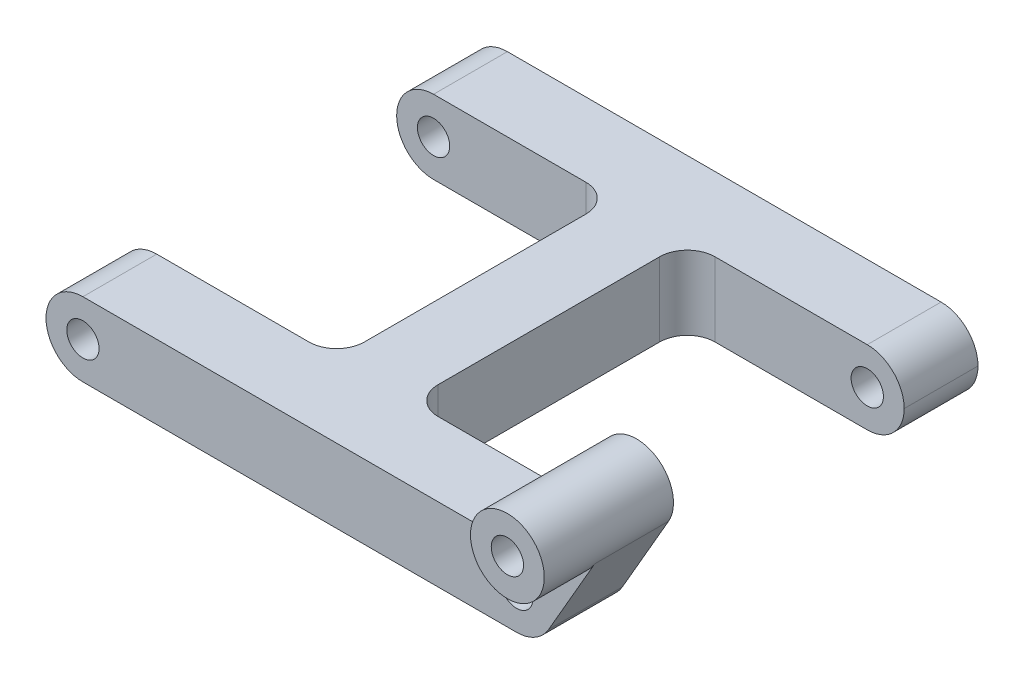
ISO-10303-21;
HEADER;
FILE_DESCRIPTION(('STEP AP214'),'2;1');
FILE_NAME('part.step','',(''),(''),'','','');
FILE_SCHEMA(('AUTOMOTIVE_DESIGN { 1 0 10303 214 1 1 1 1 }'));
ENDSEC;
DATA;
#1=APPLICATION_CONTEXT('core data for automotive mechanical design processes');
#2=APPLICATION_PROTOCOL_DEFINITION('international standard','automotive_design',2000,#1);
#3=PRODUCT_CONTEXT('',#1,'mechanical');
#4=PRODUCT('Part','Part','',(#3));
#5=PRODUCT_RELATED_PRODUCT_CATEGORY('part','',(#4));
#6=PRODUCT_DEFINITION_FORMATION('','',#4);
#7=PRODUCT_DEFINITION_CONTEXT('part definition',#1,'design');
#8=PRODUCT_DEFINITION('design','',#6,#7);
#9=PRODUCT_DEFINITION_SHAPE('','',#8);
#10=(LENGTH_UNIT() NAMED_UNIT(*) SI_UNIT(.MILLI.,.METRE.));
#11=(NAMED_UNIT(*) PLANE_ANGLE_UNIT() SI_UNIT($,.RADIAN.));
#12=(NAMED_UNIT(*) SI_UNIT($,.STERADIAN.) SOLID_ANGLE_UNIT());
#13=UNCERTAINTY_MEASURE_WITH_UNIT(LENGTH_MEASURE(1.E-05),#10,'distance_accuracy_value','');
#14=(GEOMETRIC_REPRESENTATION_CONTEXT(3) GLOBAL_UNCERTAINTY_ASSIGNED_CONTEXT((#13)) GLOBAL_UNIT_ASSIGNED_CONTEXT((#10,
#11,#12)) REPRESENTATION_CONTEXT('',''));
#15=CARTESIAN_POINT('',(0.,0.,0.));
#16=DIRECTION('',(0.,0.,1.));
#17=DIRECTION('',(1.,0.,0.));
#18=AXIS2_PLACEMENT_3D('',#15,#16,#17);
#19=CARTESIAN_POINT('',(-23.5,1.3965925355343E-13,-23.));
#20=DIRECTION('',(0.,0.,1.));
#21=DIRECTION('',(1.,0.,0.));
#22=AXIS2_PLACEMENT_3D('',#19,#20,#21);
#23=CYLINDRICAL_SURFACE('',#22,1.74999999999996);
#24=CARTESIAN_POINT('',(-23.5,1.3965925355343E-13,-15.));
#25=DIRECTION('',(0.,0.,-1.));
#26=DIRECTION('',(-1.,0.,0.));
#27=AXIS2_PLACEMENT_3D('',#24,#25,#26);
#28=CIRCLE('',#27,1.74999999999996);
#29=CARTESIAN_POINT('',(-25.25,1.3965925355343E-13,-15.));
#30=VERTEX_POINT('',#29);
#31=EDGE_CURVE('E228',#30,#30,#28,.T.);
#32=ORIENTED_EDGE('',*,*,#31,.F.);
#33=EDGE_LOOP('',(#32));
#34=FACE_BOUND('',#33,.T.);
#35=CARTESIAN_POINT('',(-23.5,1.3965925355343E-13,-19.8));
#36=DIRECTION('',(0.,0.,-1.));
#37=DIRECTION('',(-1.,0.,0.));
#38=AXIS2_PLACEMENT_3D('',#35,#36,#37);
#39=CIRCLE('',#38,1.74999999999996);
#40=CARTESIAN_POINT('',(-25.25,1.3965925355343E-13,-19.8));
#41=VERTEX_POINT('',#40);
#42=EDGE_CURVE('E40',#41,#41,#39,.F.);
#43=ORIENTED_EDGE('',*,*,#42,.F.);
#44=EDGE_LOOP('',(#43));
#45=FACE_BOUND('',#44,.T.);
#46=ADVANCED_FACE('F36',(#34,#45),#23,.F.);
#47=CARTESIAN_POINT('',(0.,4.,0.));
#48=DIRECTION('',(0.,1.,0.));
#49=DIRECTION('',(0.,0.,1.));
#50=AXIS2_PLACEMENT_3D('',#47,#48,#49);
#51=PLANE('',#50);
#52=DIRECTION('',(1.,0.,0.));
#53=VECTOR('',#52,1.);
#54=CARTESIAN_POINT('',(27.5,4.,23.));
#55=LINE('',#54,#53);
#56=CARTESIAN_POINT('',(-23.5,4.,23.));
#57=VERTEX_POINT('',#56);
#58=CARTESIAN_POINT('',(21.1905989232415,4.,23.));
#59=VERTEX_POINT('',#58);
#60=EDGE_CURVE('E247',#57,#59,#55,.T.);
#61=ORIENTED_EDGE('',*,*,#60,.T.);
#62=DIRECTION('',(0.,0.,-1.));
#63=VECTOR('',#62,1.);
#64=CARTESIAN_POINT('',(21.1905989232415,4.,0.));
#65=LINE('',#64,#63);
#66=CARTESIAN_POINT('',(21.1905989232415,4.,15.));
#67=VERTEX_POINT('',#66);
#68=EDGE_CURVE('E45',#59,#67,#65,.T.);
#69=ORIENTED_EDGE('',*,*,#68,.T.);
#70=DIRECTION('',(-1.,0.,0.));
#71=VECTOR('',#70,1.);
#72=CARTESIAN_POINT('',(27.5,4.,15.));
#73=LINE('',#72,#71);
#74=CARTESIAN_POINT('',(7.00000000000001,4.,15.));
#75=VERTEX_POINT('',#74);
#76=EDGE_CURVE('E250',#67,#75,#73,.T.);
#77=ORIENTED_EDGE('',*,*,#76,.T.);
#78=CARTESIAN_POINT('',(7.,4.,12.));
#79=DIRECTION('',(0.,1.,0.));
#80=DIRECTION('',(0.,0.,1.));
#81=AXIS2_PLACEMENT_3D('',#78,#79,#80);
#82=CIRCLE('',#81,3.);
#83=CARTESIAN_POINT('',(4.,4.,12.));
#84=VERTEX_POINT('',#83);
#85=EDGE_CURVE('E363',#75,#84,#82,.F.);
#86=ORIENTED_EDGE('',*,*,#85,.T.);
#87=DIRECTION('',(0.,0.,-1.));
#88=VECTOR('',#87,1.);
#89=CARTESIAN_POINT('',(4.,4.,15.));
#90=LINE('',#89,#88);
#91=CARTESIAN_POINT('',(4.,4.,-12.));
#92=VERTEX_POINT('',#91);
#93=EDGE_CURVE('E252',#84,#92,#90,.T.);
#94=ORIENTED_EDGE('',*,*,#93,.T.);
#95=CARTESIAN_POINT('',(7.,4.,-12.));
#96=DIRECTION('',(0.,1.,0.));
#97=DIRECTION('',(0.,0.,1.));
#98=AXIS2_PLACEMENT_3D('',#95,#96,#97);
#99=CIRCLE('',#98,3.);
#100=CARTESIAN_POINT('',(7.,4.,-15.));
#101=VERTEX_POINT('',#100);
#102=EDGE_CURVE('E61',#92,#101,#99,.F.);
#103=ORIENTED_EDGE('',*,*,#102,.T.);
#104=DIRECTION('',(1.,0.,0.));
#105=VECTOR('',#104,1.);
#106=CARTESIAN_POINT('',(4.,4.,-15.));
#107=LINE('',#106,#105);
#108=CARTESIAN_POINT('',(23.5,4.,-15.));
#109=VERTEX_POINT('',#108);
#110=EDGE_CURVE('E254',#101,#109,#107,.T.);
#111=ORIENTED_EDGE('',*,*,#110,.T.);
#112=DIRECTION('',(0.,0.,-1.));
#113=VECTOR('',#112,1.);
#114=CARTESIAN_POINT('',(23.5,4.,-23.));
#115=LINE('',#114,#113);
#116=CARTESIAN_POINT('',(23.5,4.,-23.));
#117=VERTEX_POINT('',#116);
#118=EDGE_CURVE('E302',#109,#117,#115,.T.);
#119=ORIENTED_EDGE('',*,*,#118,.T.);
#120=DIRECTION('',(-1.,0.,0.));
#121=VECTOR('',#120,1.);
#122=CARTESIAN_POINT('',(27.5,4.,-23.));
#123=LINE('',#122,#121);
#124=CARTESIAN_POINT('',(-23.5,4.,-23.));
#125=VERTEX_POINT('',#124);
#126=EDGE_CURVE('E256',#117,#125,#123,.T.);
#127=ORIENTED_EDGE('',*,*,#126,.T.);
#128=DIRECTION('',(0.,0.,1.));
#129=VECTOR('',#128,1.);
#130=CARTESIAN_POINT('',(-23.5,4.,-15.));
#131=LINE('',#130,#129);
#132=CARTESIAN_POINT('',(-23.5,4.,-15.));
#133=VERTEX_POINT('',#132);
#134=EDGE_CURVE('E306',#125,#133,#131,.T.);
#135=ORIENTED_EDGE('',*,*,#134,.T.);
#136=DIRECTION('',(1.,0.,0.));
#137=VECTOR('',#136,1.);
#138=CARTESIAN_POINT('',(-4.,4.,-15.));
#139=LINE('',#138,#137);
#140=CARTESIAN_POINT('',(-7.,4.,-15.));
#141=VERTEX_POINT('',#140);
#142=EDGE_CURVE('E238',#133,#141,#139,.T.);
#143=ORIENTED_EDGE('',*,*,#142,.T.);
#144=CARTESIAN_POINT('',(-7.,4.,-12.));
#145=DIRECTION('',(0.,1.,0.));
#146=DIRECTION('',(0.,0.,1.));
#147=AXIS2_PLACEMENT_3D('',#144,#145,#146);
#148=CIRCLE('',#147,3.);
#149=CARTESIAN_POINT('',(-4.,4.,-12.));
#150=VERTEX_POINT('',#149);
#151=EDGE_CURVE('E359',#141,#150,#148,.F.);
#152=ORIENTED_EDGE('',*,*,#151,.T.);
#153=DIRECTION('',(0.,0.,1.));
#154=VECTOR('',#153,1.);
#155=CARTESIAN_POINT('',(-4.,4.,15.));
#156=LINE('',#155,#154);
#157=CARTESIAN_POINT('',(-4.,4.,12.));
#158=VERTEX_POINT('',#157);
#159=EDGE_CURVE('E241',#150,#158,#156,.T.);
#160=ORIENTED_EDGE('',*,*,#159,.T.);
#161=CARTESIAN_POINT('',(-7.,4.,12.));
#162=DIRECTION('',(0.,1.,0.));
#163=DIRECTION('',(0.,0.,1.));
#164=AXIS2_PLACEMENT_3D('',#161,#162,#163);
#165=CIRCLE('',#164,3.);
#166=CARTESIAN_POINT('',(-7.,4.,15.));
#167=VERTEX_POINT('',#166);
#168=EDGE_CURVE('E355',#158,#167,#165,.F.);
#169=ORIENTED_EDGE('',*,*,#168,.T.);
#170=DIRECTION('',(-1.,0.,0.));
#171=VECTOR('',#170,1.);
#172=CARTESIAN_POINT('',(-27.5,4.,15.));
#173=LINE('',#172,#171);
#174=CARTESIAN_POINT('',(-23.5,4.,15.));
#175=VERTEX_POINT('',#174);
#176=EDGE_CURVE('E245',#167,#175,#173,.T.);
#177=ORIENTED_EDGE('',*,*,#176,.T.);
#178=DIRECTION('',(0.,0.,1.));
#179=VECTOR('',#178,1.);
#180=CARTESIAN_POINT('',(-23.5,4.,23.));
#181=LINE('',#180,#179);
#182=EDGE_CURVE('E304',#175,#57,#181,.T.);
#183=ORIENTED_EDGE('',*,*,#182,.T.);
#184=EDGE_LOOP('',(#61,#69,#77,#86,#94,#103,#111,#119,#127,#135,#143,#152,#160,#169,#177,#183));
#185=FACE_BOUND('',#184,.T.);
#186=ADVANCED_FACE('F369',(#185),#51,.T.);
#187=CARTESIAN_POINT('',(23.5,0.,23.));
#188=DIRECTION('',(0.,0.,-1.));
#189=DIRECTION('',(-1.,0.,0.));
#190=AXIS2_PLACEMENT_3D('',#187,#188,#189);
#191=CYLINDRICAL_SURFACE('',#190,4.);
#192=CARTESIAN_POINT('',(23.5,0.,15.));
#193=DIRECTION('',(0.,0.,1.));
#194=DIRECTION('',(1.,0.,0.));
#195=AXIS2_PLACEMENT_3D('',#192,#193,#194);
#196=CIRCLE('',#195,4.);
#197=CARTESIAN_POINT('',(26.9641016151378,-2.,15.));
#198=VERTEX_POINT('',#197);
#199=CARTESIAN_POINT('',(23.5,-4.,15.));
#200=VERTEX_POINT('',#199);
#201=EDGE_CURVE('E323',#198,#200,#196,.F.);
#202=ORIENTED_EDGE('',*,*,#201,.F.);
#203=DIRECTION('',(0.,0.,-1.));
#204=VECTOR('',#203,1.);
#205=CARTESIAN_POINT('',(26.9641016151378,-2.,23.));
#206=LINE('',#205,#204);
#207=CARTESIAN_POINT('',(26.9641016151378,-2.,23.));
#208=VERTEX_POINT('',#207);
#209=EDGE_CURVE('E208',#208,#198,#206,.T.);
#210=ORIENTED_EDGE('',*,*,#209,.F.);
#211=CARTESIAN_POINT('',(23.5,0.,23.));
#212=DIRECTION('',(0.,0.,-1.));
#213=DIRECTION('',(-1.,0.,0.));
#214=AXIS2_PLACEMENT_3D('',#211,#212,#213);
#215=CIRCLE('',#214,4.);
#216=CARTESIAN_POINT('',(23.5,-4.,23.));
#217=VERTEX_POINT('',#216);
#218=EDGE_CURVE('E202',#217,#208,#215,.F.);
#219=ORIENTED_EDGE('',*,*,#218,.F.);
#220=DIRECTION('',(0.,0.,-1.));
#221=VECTOR('',#220,1.);
#222=CARTESIAN_POINT('',(23.5,-4.,0.));
#223=LINE('',#222,#221);
#224=EDGE_CURVE('E282',#200,#217,#223,.F.);
#225=ORIENTED_EDGE('',*,*,#224,.F.);
#226=EDGE_LOOP('',(#202,#210,#219,#225));
#227=FACE_BOUND('',#226,.T.);
#228=ADVANCED_FACE('F478',(#227),#191,.T.);
#229=CARTESIAN_POINT('',(-4.,4.,-15.));
#230=DIRECTION('',(0.,0.,-1.));
#231=DIRECTION('',(-1.,0.,0.));
#232=AXIS2_PLACEMENT_3D('',#229,#230,#231);
#233=PLANE('',#232);
#234=ORIENTED_EDGE('',*,*,#31,.T.);
#235=EDGE_LOOP('',(#234));
#236=FACE_BOUND('',#235,.T.);
#237=DIRECTION('',(1.,0.,0.));
#238=VECTOR('',#237,1.);
#239=CARTESIAN_POINT('',(-4.,-4.,-15.));
#240=LINE('',#239,#238);
#241=CARTESIAN_POINT('',(-23.5,-4.,-15.));
#242=VERTEX_POINT('',#241);
#243=CARTESIAN_POINT('',(-7.,-4.,-15.));
#244=VERTEX_POINT('',#243);
#245=EDGE_CURVE('E237',#242,#244,#240,.T.);
#246=ORIENTED_EDGE('',*,*,#245,.T.);
#247=DIRECTION('',(0.,-1.,0.));
#248=VECTOR('',#247,1.);
#249=CARTESIAN_POINT('',(-7.,4.,-15.));
#250=LINE('',#249,#248);
#251=EDGE_CURVE('E340',#244,#141,#250,.F.);
#252=ORIENTED_EDGE('',*,*,#251,.T.);
#253=ORIENTED_EDGE('',*,*,#142,.F.);
#254=CARTESIAN_POINT('',(-23.5,0.,-15.));
#255=DIRECTION('',(0.,0.,-1.));
#256=DIRECTION('',(-1.,0.,0.));
#257=AXIS2_PLACEMENT_3D('',#254,#255,#256);
#258=CIRCLE('',#257,4.);
#259=CARTESIAN_POINT('',(-27.5,0.,-15.));
#260=VERTEX_POINT('',#259);
#261=EDGE_CURVE('E259',#133,#260,#258,.F.);
#262=ORIENTED_EDGE('',*,*,#261,.T.);
#263=CARTESIAN_POINT('',(-23.5,0.,-15.));
#264=DIRECTION('',(0.,0.,-1.));
#265=DIRECTION('',(-1.,0.,0.));
#266=AXIS2_PLACEMENT_3D('',#263,#264,#265);
#267=CIRCLE('',#266,4.);
#268=EDGE_CURVE('E280',#260,#242,#267,.F.);
#269=ORIENTED_EDGE('',*,*,#268,.T.);
#270=EDGE_LOOP('',(#246,#252,#253,#262,#269));
#271=FACE_BOUND('',#270,.T.);
#272=ADVANCED_FACE('F421',(#236,#271),#233,.F.);
#273=CARTESIAN_POINT('',(-4.,4.,15.));
#274=DIRECTION('',(1.,0.,0.));
#275=DIRECTION('',(0.,0.,-1.));
#276=AXIS2_PLACEMENT_3D('',#273,#274,#275);
#277=PLANE('',#276);
#278=DIRECTION('',(0.,0.,1.));
#279=VECTOR('',#278,1.);
#280=CARTESIAN_POINT('',(-4.,-4.,15.));
#281=LINE('',#280,#279);
#282=CARTESIAN_POINT('',(-4.,-4.,-12.));
#283=VERTEX_POINT('',#282);
#284=CARTESIAN_POINT('',(-4.,-4.,12.));
#285=VERTEX_POINT('',#284);
#286=EDGE_CURVE('E262',#283,#285,#281,.T.);
#287=ORIENTED_EDGE('',*,*,#286,.T.);
#288=DIRECTION('',(0.,-1.,0.));
#289=VECTOR('',#288,1.);
#290=CARTESIAN_POINT('',(-4.,4.,12.));
#291=LINE('',#290,#289);
#292=EDGE_CURVE('E338',#285,#158,#291,.F.);
#293=ORIENTED_EDGE('',*,*,#292,.T.);
#294=ORIENTED_EDGE('',*,*,#159,.F.);
#295=DIRECTION('',(0.,-1.,0.));
#296=VECTOR('',#295,1.);
#297=CARTESIAN_POINT('',(-4.,-4.,-12.));
#298=LINE('',#297,#296);
#299=EDGE_CURVE('E335',#150,#283,#298,.T.);
#300=ORIENTED_EDGE('',*,*,#299,.T.);
#301=EDGE_LOOP('',(#287,#293,#294,#300));
#302=FACE_BOUND('',#301,.T.);
#303=ADVANCED_FACE('F431',(#302),#277,.F.);
#304=CARTESIAN_POINT('',(-27.5,4.,15.));
#305=DIRECTION('',(0.,0.,1.));
#306=DIRECTION('',(1.,0.,0.));
#307=AXIS2_PLACEMENT_3D('',#304,#305,#306);
#308=PLANE('',#307);
#309=CARTESIAN_POINT('',(-23.5,1.3965925355343E-13,15.));
#310=DIRECTION('',(0.,0.,1.));
#311=DIRECTION('',(1.,0.,0.));
#312=AXIS2_PLACEMENT_3D('',#309,#310,#311);
#313=CIRCLE('',#312,1.74999999999996);
#314=CARTESIAN_POINT('',(-21.75,1.3965925355343E-13,15.));
#315=VERTEX_POINT('',#314);
#316=EDGE_CURVE('E218',#315,#315,#313,.T.);
#317=ORIENTED_EDGE('',*,*,#316,.T.);
#318=EDGE_LOOP('',(#317));
#319=FACE_BOUND('',#318,.T.);
#320=ORIENTED_EDGE('',*,*,#176,.F.);
#321=DIRECTION('',(0.,-1.,0.));
#322=VECTOR('',#321,1.);
#323=CARTESIAN_POINT('',(-7.,-4.,15.));
#324=LINE('',#323,#322);
#325=CARTESIAN_POINT('',(-7.,-4.,15.));
#326=VERTEX_POINT('',#325);
#327=EDGE_CURVE('E325',#167,#326,#324,.T.);
#328=ORIENTED_EDGE('',*,*,#327,.T.);
#329=DIRECTION('',(-1.,0.,0.));
#330=VECTOR('',#329,1.);
#331=CARTESIAN_POINT('',(-27.5,-4.,15.));
#332=LINE('',#331,#330);
#333=CARTESIAN_POINT('',(-23.5,-4.,15.));
#334=VERTEX_POINT('',#333);
#335=EDGE_CURVE('E265',#326,#334,#332,.T.);
#336=ORIENTED_EDGE('',*,*,#335,.T.);
#337=CARTESIAN_POINT('',(-23.5,0.,15.));
#338=DIRECTION('',(0.,0.,1.));
#339=DIRECTION('',(1.,0.,0.));
#340=AXIS2_PLACEMENT_3D('',#337,#338,#339);
#341=CIRCLE('',#340,4.);
#342=CARTESIAN_POINT('',(-27.5,0.,15.));
#343=VERTEX_POINT('',#342);
#344=EDGE_CURVE('E316',#334,#343,#341,.F.);
#345=ORIENTED_EDGE('',*,*,#344,.T.);
#346=CARTESIAN_POINT('',(-23.5,0.,15.));
#347=DIRECTION('',(0.,0.,1.));
#348=DIRECTION('',(1.,0.,0.));
#349=AXIS2_PLACEMENT_3D('',#346,#347,#348);
#350=CIRCLE('',#349,4.);
#351=EDGE_CURVE('E313',#343,#175,#350,.F.);
#352=ORIENTED_EDGE('',*,*,#351,.T.);
#353=EDGE_LOOP('',(#320,#328,#336,#345,#352));
#354=FACE_BOUND('',#353,.T.);
#355=ADVANCED_FACE('F440',(#319,#354),#308,.F.);
#356=CARTESIAN_POINT('',(27.5,4.,23.));
#357=DIRECTION('',(0.,0.,-1.));
#358=DIRECTION('',(-1.,0.,0.));
#359=AXIS2_PLACEMENT_3D('',#356,#357,#358);
#360=PLANE('',#359);
#361=DIRECTION('',(0.499999999999999,0.866025403784439,0.));
#362=VECTOR('',#361,1.);
#363=CARTESIAN_POINT('',(29.6961524227066,2.73205080756888,23.));
#364=LINE('',#363,#362);
#365=CARTESIAN_POINT('',(31.9641016151377,6.6602540378444,23.));
#366=VERTEX_POINT('',#365);
#367=EDGE_CURVE('E53',#208,#366,#364,.T.);
#368=ORIENTED_EDGE('',*,*,#367,.T.);
#369=CARTESIAN_POINT('',(28.5,8.6602540378444,23.));
#370=DIRECTION('',(0.,0.,-1.));
#371=DIRECTION('',(-1.,0.,0.));
#372=AXIS2_PLACEMENT_3D('',#369,#370,#371);
#373=CIRCLE('',#372,4.);
#374=CARTESIAN_POINT('',(25.0358983848622,10.6602540378444,23.));
#375=VERTEX_POINT('',#374);
#376=EDGE_CURVE('E11',#366,#375,#373,.T.);
#377=ORIENTED_EDGE('',*,*,#376,.T.);
#378=DIRECTION('',(-0.499999999999996,-0.866025403784441,0.));
#379=VECTOR('',#378,1.);
#380=CARTESIAN_POINT('',(22.7679491924311,6.73205080756886,23.));
#381=LINE('',#380,#379);
#382=EDGE_CURVE('E203',#375,#59,#381,.T.);
#383=ORIENTED_EDGE('',*,*,#382,.T.);
#384=ORIENTED_EDGE('',*,*,#60,.F.);
#385=CARTESIAN_POINT('',(-23.5,0.,23.));
#386=DIRECTION('',(0.,0.,-1.));
#387=DIRECTION('',(-1.,0.,0.));
#388=AXIS2_PLACEMENT_3D('',#385,#386,#387);
#389=CIRCLE('',#388,4.);
#390=CARTESIAN_POINT('',(-27.5,0.,23.));
#391=VERTEX_POINT('',#390);
#392=EDGE_CURVE('E309',#57,#391,#389,.F.);
#393=ORIENTED_EDGE('',*,*,#392,.T.);
#394=CARTESIAN_POINT('',(-23.5,0.,23.));
#395=DIRECTION('',(0.,0.,-1.));
#396=DIRECTION('',(-1.,0.,0.));
#397=AXIS2_PLACEMENT_3D('',#394,#395,#396);
#398=CIRCLE('',#397,4.);
#399=CARTESIAN_POINT('',(-23.5,-4.,23.));
#400=VERTEX_POINT('',#399);
#401=EDGE_CURVE('E311',#391,#400,#398,.F.);
#402=ORIENTED_EDGE('',*,*,#401,.T.);
#403=DIRECTION('',(1.,0.,0.));
#404=VECTOR('',#403,1.);
#405=CARTESIAN_POINT('',(27.5,-4.,23.));
#406=LINE('',#405,#404);
#407=EDGE_CURVE('E267',#400,#217,#406,.T.);
#408=ORIENTED_EDGE('',*,*,#407,.T.);
#409=ORIENTED_EDGE('',*,*,#218,.T.);
#410=EDGE_LOOP('',(#368,#377,#383,#384,#393,#402,#408,#409));
#411=FACE_BOUND('',#410,.T.);
#412=CARTESIAN_POINT('',(23.5,0.,23.));
#413=DIRECTION('',(0.,0.,1.));
#414=DIRECTION('',(1.,0.,0.));
#415=AXIS2_PLACEMENT_3D('',#412,#413,#414);
#416=CIRCLE('',#415,1.75);
#417=CARTESIAN_POINT('',(25.25,0.,23.));
#418=VERTEX_POINT('',#417);
#419=EDGE_CURVE('E219',#418,#418,#416,.T.);
#420=ORIENTED_EDGE('',*,*,#419,.F.);
#421=EDGE_LOOP('',(#420));
#422=FACE_BOUND('',#421,.T.);
#423=CARTESIAN_POINT('',(-23.5,1.3965925355343E-13,23.));
#424=DIRECTION('',(0.,0.,1.));
#425=DIRECTION('',(1.,0.,0.));
#426=AXIS2_PLACEMENT_3D('',#423,#424,#425);
#427=CIRCLE('',#426,1.74999999999996);
#428=CARTESIAN_POINT('',(-21.75,1.3965925355343E-13,23.));
#429=VERTEX_POINT('',#428);
#430=EDGE_CURVE('E222',#429,#429,#427,.T.);
#431=ORIENTED_EDGE('',*,*,#430,.F.);
#432=EDGE_LOOP('',(#431));
#433=FACE_BOUND('',#432,.T.);
#434=ADVANCED_FACE('F199',(#411,#422,#433),#360,.F.);
#435=CARTESIAN_POINT('',(27.5,4.,15.));
#436=DIRECTION('',(0.,0.,1.));
#437=DIRECTION('',(1.,0.,0.));
#438=AXIS2_PLACEMENT_3D('',#435,#436,#437);
#439=PLANE('',#438);
#440=ORIENTED_EDGE('',*,*,#201,.T.);
#441=DIRECTION('',(-1.,0.,0.));
#442=VECTOR('',#441,1.);
#443=CARTESIAN_POINT('',(27.5,-4.,15.));
#444=LINE('',#443,#442);
#445=CARTESIAN_POINT('',(7.00000000000001,-4.,15.));
#446=VERTEX_POINT('',#445);
#447=EDGE_CURVE('E269',#200,#446,#444,.T.);
#448=ORIENTED_EDGE('',*,*,#447,.T.);
#449=DIRECTION('',(0.,-1.,0.));
#450=VECTOR('',#449,1.);
#451=CARTESIAN_POINT('',(7.,4.,15.));
#452=LINE('',#451,#450);
#453=EDGE_CURVE('E347',#446,#75,#452,.F.);
#454=ORIENTED_EDGE('',*,*,#453,.T.);
#455=ORIENTED_EDGE('',*,*,#76,.F.);
#456=DIRECTION('',(-0.499999999999996,-0.866025403784441,0.));
#457=VECTOR('',#456,1.);
#458=CARTESIAN_POINT('',(22.7679491924311,6.73205080756886,15.));
#459=LINE('',#458,#457);
#460=CARTESIAN_POINT('',(25.0358983848622,10.6602540378444,15.));
#461=VERTEX_POINT('',#460);
#462=EDGE_CURVE('E204',#461,#67,#459,.T.);
#463=ORIENTED_EDGE('',*,*,#462,.F.);
#464=CARTESIAN_POINT('',(28.5,8.6602540378444,15.));
#465=DIRECTION('',(0.,0.,1.));
#466=DIRECTION('',(1.,0.,0.));
#467=AXIS2_PLACEMENT_3D('',#464,#465,#466);
#468=CIRCLE('',#467,4.00000000000001);
#469=CARTESIAN_POINT('',(31.9641016151378,6.66025403784441,15.));
#470=VERTEX_POINT('',#469);
#471=EDGE_CURVE('E457',#470,#461,#468,.T.);
#472=ORIENTED_EDGE('',*,*,#471,.F.);
#473=DIRECTION('',(0.499999999999999,0.866025403784439,0.));
#474=VECTOR('',#473,1.);
#475=CARTESIAN_POINT('',(29.6961524227066,2.73205080756888,15.));
#476=LINE('',#475,#474);
#477=EDGE_CURVE('E207',#198,#470,#476,.T.);
#478=ORIENTED_EDGE('',*,*,#477,.F.);
#479=EDGE_LOOP('',(#440,#448,#454,#455,#463,#472,#478));
#480=FACE_BOUND('',#479,.T.);
#481=CARTESIAN_POINT('',(23.5,0.,15.));
#482=DIRECTION('',(0.,0.,1.));
#483=DIRECTION('',(1.,0.,0.));
#484=AXIS2_PLACEMENT_3D('',#481,#482,#483);
#485=CIRCLE('',#484,1.75);
#486=CARTESIAN_POINT('',(25.25,0.,15.));
#487=VERTEX_POINT('',#486);
#488=EDGE_CURVE('E234',#487,#487,#485,.T.);
#489=ORIENTED_EDGE('',*,*,#488,.T.);
#490=EDGE_LOOP('',(#489));
#491=FACE_BOUND('',#490,.T.);
#492=CARTESIAN_POINT('',(28.5,8.6602540378444,15.));
#493=DIRECTION('',(0.,0.,1.));
#494=DIRECTION('',(1.,0.,0.));
#495=AXIS2_PLACEMENT_3D('',#492,#493,#494);
#496=CIRCLE('',#495,1.75);
#497=CARTESIAN_POINT('',(30.25,8.6602540378444,15.));
#498=VERTEX_POINT('',#497);
#499=EDGE_CURVE('E458',#498,#498,#496,.T.);
#500=ORIENTED_EDGE('',*,*,#499,.T.);
#501=EDGE_LOOP('',(#500));
#502=FACE_BOUND('',#501,.T.);
#503=ADVANCED_FACE('F374',(#480,#491,#502),#439,.F.);
#504=CARTESIAN_POINT('',(4.,4.,15.));
#505=DIRECTION('',(-1.,0.,0.));
#506=DIRECTION('',(0.,0.,1.));
#507=AXIS2_PLACEMENT_3D('',#504,#505,#506);
#508=PLANE('',#507);
#509=ORIENTED_EDGE('',*,*,#93,.F.);
#510=DIRECTION('',(0.,-1.,0.));
#511=VECTOR('',#510,1.);
#512=CARTESIAN_POINT('',(4.,-4.,12.));
#513=LINE('',#512,#511);
#514=CARTESIAN_POINT('',(4.,-4.,12.));
#515=VERTEX_POINT('',#514);
#516=EDGE_CURVE('E344',#84,#515,#513,.T.);
#517=ORIENTED_EDGE('',*,*,#516,.T.);
#518=DIRECTION('',(0.,0.,-1.));
#519=VECTOR('',#518,1.);
#520=CARTESIAN_POINT('',(4.,-4.,15.));
#521=LINE('',#520,#519);
#522=CARTESIAN_POINT('',(4.,-4.,-12.));
#523=VERTEX_POINT('',#522);
#524=EDGE_CURVE('E272',#515,#523,#521,.T.);
#525=ORIENTED_EDGE('',*,*,#524,.T.);
#526=DIRECTION('',(0.,-1.,0.));
#527=VECTOR('',#526,1.);
#528=CARTESIAN_POINT('',(4.,4.,-12.));
#529=LINE('',#528,#527);
#530=EDGE_CURVE('E342',#523,#92,#529,.F.);
#531=ORIENTED_EDGE('',*,*,#530,.T.);
#532=EDGE_LOOP('',(#509,#517,#525,#531));
#533=FACE_BOUND('',#532,.T.);
#534=ADVANCED_FACE('F384',(#533),#508,.F.);
#535=CARTESIAN_POINT('',(4.,4.,-15.));
#536=DIRECTION('',(0.,0.,-1.));
#537=DIRECTION('',(-1.,0.,0.));
#538=AXIS2_PLACEMENT_3D('',#535,#536,#537);
#539=PLANE('',#538);
#540=CARTESIAN_POINT('',(23.5,0.,-15.));
#541=DIRECTION('',(0.,0.,-1.));
#542=DIRECTION('',(-1.,0.,0.));
#543=AXIS2_PLACEMENT_3D('',#540,#541,#542);
#544=CIRCLE('',#543,1.75);
#545=CARTESIAN_POINT('',(21.75,0.,-15.));
#546=VERTEX_POINT('',#545);
#547=EDGE_CURVE('E231',#546,#546,#544,.T.);
#548=ORIENTED_EDGE('',*,*,#547,.T.);
#549=EDGE_LOOP('',(#548));
#550=FACE_BOUND('',#549,.T.);
#551=ORIENTED_EDGE('',*,*,#110,.F.);
#552=DIRECTION('',(0.,-1.,0.));
#553=VECTOR('',#552,1.);
#554=CARTESIAN_POINT('',(7.,-4.,-15.));
#555=LINE('',#554,#553);
#556=CARTESIAN_POINT('',(7.,-4.,-15.));
#557=VERTEX_POINT('',#556);
#558=EDGE_CURVE('E350',#101,#557,#555,.T.);
#559=ORIENTED_EDGE('',*,*,#558,.T.);
#560=DIRECTION('',(1.,0.,0.));
#561=VECTOR('',#560,1.);
#562=CARTESIAN_POINT('',(4.,-4.,-15.));
#563=LINE('',#562,#561);
#564=CARTESIAN_POINT('',(23.5,-4.,-15.));
#565=VERTEX_POINT('',#564);
#566=EDGE_CURVE('E275',#557,#565,#563,.T.);
#567=ORIENTED_EDGE('',*,*,#566,.T.);
#568=CARTESIAN_POINT('',(23.5,0.,-15.));
#569=DIRECTION('',(0.,0.,-1.));
#570=DIRECTION('',(-1.,0.,0.));
#571=AXIS2_PLACEMENT_3D('',#568,#569,#570);
#572=CIRCLE('',#571,4.);
#573=CARTESIAN_POINT('',(27.5,0.,-15.));
#574=VERTEX_POINT('',#573);
#575=EDGE_CURVE('E321',#565,#574,#572,.F.);
#576=ORIENTED_EDGE('',*,*,#575,.T.);
#577=CARTESIAN_POINT('',(23.5,0.,-15.));
#578=DIRECTION('',(0.,0.,-1.));
#579=DIRECTION('',(-1.,0.,0.));
#580=AXIS2_PLACEMENT_3D('',#577,#578,#579);
#581=CIRCLE('',#580,4.);
#582=EDGE_CURVE('E318',#574,#109,#581,.F.);
#583=ORIENTED_EDGE('',*,*,#582,.T.);
#584=EDGE_LOOP('',(#551,#559,#567,#576,#583));
#585=FACE_BOUND('',#584,.T.);
#586=ADVANCED_FACE('F391',(#550,#585),#539,.F.);
#587=CARTESIAN_POINT('',(27.5,4.,-23.));
#588=DIRECTION('',(0.,0.,1.));
#589=DIRECTION('',(1.,0.,0.));
#590=AXIS2_PLACEMENT_3D('',#587,#588,#589);
#591=PLANE('',#590);
#592=CARTESIAN_POINT('',(-23.5,1.3965925355343E-13,-23.));
#593=DIRECTION('',(0.,0.,-1.));
#594=DIRECTION('',(-1.,0.,0.));
#595=AXIS2_PLACEMENT_3D('',#592,#593,#594);
#596=CIRCLE('',#595,3.1);
#597=CARTESIAN_POINT('',(-26.6,1.3965925355343E-13,-23.));
#598=VERTEX_POINT('',#597);
#599=EDGE_CURVE('E616',#598,#598,#596,.T.);
#600=ORIENTED_EDGE('',*,*,#599,.F.);
#601=EDGE_LOOP('',(#600));
#602=FACE_BOUND('',#601,.T.);
#603=CARTESIAN_POINT('',(23.5,0.,-23.));
#604=DIRECTION('',(0.,0.,1.));
#605=DIRECTION('',(1.,0.,0.));
#606=AXIS2_PLACEMENT_3D('',#603,#604,#605);
#607=CIRCLE('',#606,1.75);
#608=CARTESIAN_POINT('',(25.25,0.,-23.));
#609=VERTEX_POINT('',#608);
#610=EDGE_CURVE('E215',#609,#609,#607,.T.);
#611=ORIENTED_EDGE('',*,*,#610,.T.);
#612=EDGE_LOOP('',(#611));
#613=FACE_BOUND('',#612,.T.);
#614=DIRECTION('',(-1.,0.,0.));
#615=VECTOR('',#614,1.);
#616=CARTESIAN_POINT('',(27.5,-4.,-23.));
#617=LINE('',#616,#615);
#618=CARTESIAN_POINT('',(23.5,-4.,-23.));
#619=VERTEX_POINT('',#618);
#620=CARTESIAN_POINT('',(-23.5,-4.,-23.));
#621=VERTEX_POINT('',#620);
#622=EDGE_CURVE('E242',#619,#621,#617,.T.);
#623=ORIENTED_EDGE('',*,*,#622,.T.);
#624=CARTESIAN_POINT('',(-23.5,0.,-23.));
#625=DIRECTION('',(0.,0.,1.));
#626=DIRECTION('',(1.,0.,0.));
#627=AXIS2_PLACEMENT_3D('',#624,#625,#626);
#628=CIRCLE('',#627,4.);
#629=CARTESIAN_POINT('',(-27.5,0.,-23.));
#630=VERTEX_POINT('',#629);
#631=EDGE_CURVE('E300',#621,#630,#628,.F.);
#632=ORIENTED_EDGE('',*,*,#631,.T.);
#633=CARTESIAN_POINT('',(-23.5,0.,-23.));
#634=DIRECTION('',(0.,0.,1.));
#635=DIRECTION('',(1.,0.,0.));
#636=AXIS2_PLACEMENT_3D('',#633,#634,#635);
#637=CIRCLE('',#636,4.);
#638=EDGE_CURVE('E298',#630,#125,#637,.F.);
#639=ORIENTED_EDGE('',*,*,#638,.T.);
#640=ORIENTED_EDGE('',*,*,#126,.F.);
#641=CARTESIAN_POINT('',(23.5,0.,-23.));
#642=DIRECTION('',(0.,0.,1.));
#643=DIRECTION('',(1.,0.,0.));
#644=AXIS2_PLACEMENT_3D('',#641,#642,#643);
#645=CIRCLE('',#644,4.);
#646=CARTESIAN_POINT('',(27.5,0.,-23.));
#647=VERTEX_POINT('',#646);
#648=EDGE_CURVE('E294',#117,#647,#645,.F.);
#649=ORIENTED_EDGE('',*,*,#648,.T.);
#650=CARTESIAN_POINT('',(23.5,0.,-23.));
#651=DIRECTION('',(0.,0.,1.));
#652=DIRECTION('',(1.,0.,0.));
#653=AXIS2_PLACEMENT_3D('',#650,#651,#652);
#654=CIRCLE('',#653,4.);
#655=EDGE_CURVE('E296',#647,#619,#654,.F.);
#656=ORIENTED_EDGE('',*,*,#655,.T.);
#657=EDGE_LOOP('',(#623,#632,#639,#640,#649,#656));
#658=FACE_BOUND('',#657,.T.);
#659=ADVANCED_FACE('F410',(#602,#613,#658),#591,.F.);
#660=CARTESIAN_POINT('',(0.,-4.,0.));
#661=DIRECTION('',(0.,1.,0.));
#662=DIRECTION('',(0.,0.,1.));
#663=AXIS2_PLACEMENT_3D('',#660,#661,#662);
#664=PLANE('',#663);
#665=ORIENTED_EDGE('',*,*,#245,.F.);
#666=DIRECTION('',(0.,0.,1.));
#667=VECTOR('',#666,1.);
#668=CARTESIAN_POINT('',(-23.5,-4.,0.));
#669=LINE('',#668,#667);
#670=EDGE_CURVE('E291',#242,#621,#669,.F.);
#671=ORIENTED_EDGE('',*,*,#670,.T.);
#672=ORIENTED_EDGE('',*,*,#622,.F.);
#673=DIRECTION('',(0.,0.,-1.));
#674=VECTOR('',#673,1.);
#675=CARTESIAN_POINT('',(23.5,-4.,0.));
#676=LINE('',#675,#674);
#677=EDGE_CURVE('E285',#619,#565,#676,.F.);
#678=ORIENTED_EDGE('',*,*,#677,.T.);
#679=ORIENTED_EDGE('',*,*,#566,.F.);
#680=CARTESIAN_POINT('',(7.,-4.,-12.));
#681=DIRECTION('',(0.,1.,0.));
#682=DIRECTION('',(0.,0.,1.));
#683=AXIS2_PLACEMENT_3D('',#680,#681,#682);
#684=CIRCLE('',#683,3.);
#685=EDGE_CURVE('E365',#557,#523,#684,.T.);
#686=ORIENTED_EDGE('',*,*,#685,.T.);
#687=ORIENTED_EDGE('',*,*,#524,.F.);
#688=CARTESIAN_POINT('',(7.,-4.,12.));
#689=DIRECTION('',(0.,1.,0.));
#690=DIRECTION('',(0.,0.,1.));
#691=AXIS2_PLACEMENT_3D('',#688,#689,#690);
#692=CIRCLE('',#691,3.);
#693=EDGE_CURVE('E361',#515,#446,#692,.T.);
#694=ORIENTED_EDGE('',*,*,#693,.T.);
#695=ORIENTED_EDGE('',*,*,#447,.F.);
#696=ORIENTED_EDGE('',*,*,#224,.T.);
#697=ORIENTED_EDGE('',*,*,#407,.F.);
#698=DIRECTION('',(0.,0.,1.));
#699=VECTOR('',#698,1.);
#700=CARTESIAN_POINT('',(-23.5,-4.,0.));
#701=LINE('',#700,#699);
#702=EDGE_CURVE('E288',#400,#334,#701,.F.);
#703=ORIENTED_EDGE('',*,*,#702,.T.);
#704=ORIENTED_EDGE('',*,*,#335,.F.);
#705=CARTESIAN_POINT('',(-7.,-4.,12.));
#706=DIRECTION('',(0.,1.,0.));
#707=DIRECTION('',(0.,0.,1.));
#708=AXIS2_PLACEMENT_3D('',#705,#706,#707);
#709=CIRCLE('',#708,3.);
#710=EDGE_CURVE('E353',#326,#285,#709,.T.);
#711=ORIENTED_EDGE('',*,*,#710,.T.);
#712=ORIENTED_EDGE('',*,*,#286,.F.);
#713=CARTESIAN_POINT('',(-7.,-4.,-12.));
#714=DIRECTION('',(0.,1.,0.));
#715=DIRECTION('',(0.,0.,1.));
#716=AXIS2_PLACEMENT_3D('',#713,#714,#715);
#717=CIRCLE('',#716,3.);
#718=EDGE_CURVE('E357',#283,#244,#717,.T.);
#719=ORIENTED_EDGE('',*,*,#718,.T.);
#720=EDGE_LOOP('',(#665,#671,#672,#678,#679,#686,#687,#694,#695,#696,#697,#703,#704,#711,#712,#719));
#721=FACE_BOUND('',#720,.T.);
#722=ADVANCED_FACE('F395',(#721),#664,.F.);
#723=CARTESIAN_POINT('',(23.5,0.,-23.));
#724=DIRECTION('',(0.,0.,1.));
#725=DIRECTION('',(1.,0.,0.));
#726=AXIS2_PLACEMENT_3D('',#723,#724,#725);
#727=CYLINDRICAL_SURFACE('',#726,1.75);
#728=ORIENTED_EDGE('',*,*,#610,.F.);
#729=EDGE_LOOP('',(#728));
#730=FACE_BOUND('',#729,.T.);
#731=ORIENTED_EDGE('',*,*,#547,.F.);
#732=EDGE_LOOP('',(#731));
#733=FACE_BOUND('',#732,.T.);
#734=ADVANCED_FACE('F491',(#730,#733),#727,.F.);
#735=ORIENTED_EDGE('',*,*,#419,.T.);
#736=EDGE_LOOP('',(#735));
#737=FACE_BOUND('',#736,.T.);
#738=ORIENTED_EDGE('',*,*,#488,.F.);
#739=EDGE_LOOP('',(#738));
#740=FACE_BOUND('',#739,.T.);
#741=ADVANCED_FACE('F484',(#737,#740),#727,.F.);
#742=ORIENTED_EDGE('',*,*,#430,.T.);
#743=EDGE_LOOP('',(#742));
#744=FACE_BOUND('',#743,.T.);
#745=ORIENTED_EDGE('',*,*,#316,.F.);
#746=EDGE_LOOP('',(#745));
#747=FACE_BOUND('',#746,.T.);
#748=ADVANCED_FACE('F474',(#744,#747),#23,.F.);
#749=CARTESIAN_POINT('',(-23.5,0.,0.));
#750=DIRECTION('',(0.,0.,-1.));
#751=DIRECTION('',(-1.,0.,0.));
#752=AXIS2_PLACEMENT_3D('',#749,#750,#751);
#753=CYLINDRICAL_SURFACE('',#752,4.);
#754=ORIENTED_EDGE('',*,*,#134,.F.);
#755=ORIENTED_EDGE('',*,*,#638,.F.);
#756=DIRECTION('',(0.,0.,1.));
#757=VECTOR('',#756,1.);
#758=CARTESIAN_POINT('',(-27.5,0.,-23.));
#759=LINE('',#758,#757);
#760=EDGE_CURVE('E225',#260,#630,#759,.F.);
#761=ORIENTED_EDGE('',*,*,#760,.F.);
#762=ORIENTED_EDGE('',*,*,#261,.F.);
#763=EDGE_LOOP('',(#754,#755,#761,#762));
#764=FACE_BOUND('',#763,.T.);
#765=ADVANCED_FACE('F414',(#764),#753,.T.);
#766=CARTESIAN_POINT('',(-23.5,0.,-15.));
#767=DIRECTION('',(0.,0.,1.));
#768=DIRECTION('',(1.,0.,0.));
#769=AXIS2_PLACEMENT_3D('',#766,#767,#768);
#770=CYLINDRICAL_SURFACE('',#769,4.);
#771=ORIENTED_EDGE('',*,*,#631,.F.);
#772=ORIENTED_EDGE('',*,*,#670,.F.);
#773=ORIENTED_EDGE('',*,*,#268,.F.);
#774=ORIENTED_EDGE('',*,*,#760,.T.);
#775=EDGE_LOOP('',(#771,#772,#773,#774));
#776=FACE_BOUND('',#775,.T.);
#777=ADVANCED_FACE('F418',(#776),#770,.T.);
#778=CARTESIAN_POINT('',(-23.5,0.,0.));
#779=DIRECTION('',(0.,0.,-1.));
#780=DIRECTION('',(-1.,0.,0.));
#781=AXIS2_PLACEMENT_3D('',#778,#779,#780);
#782=CYLINDRICAL_SURFACE('',#781,4.);
#783=ORIENTED_EDGE('',*,*,#182,.F.);
#784=ORIENTED_EDGE('',*,*,#351,.F.);
#785=DIRECTION('',(0.,0.,1.));
#786=VECTOR('',#785,1.);
#787=CARTESIAN_POINT('',(-27.5,0.,15.));
#788=LINE('',#787,#786);
#789=EDGE_CURVE('E328',#391,#343,#788,.F.);
#790=ORIENTED_EDGE('',*,*,#789,.F.);
#791=ORIENTED_EDGE('',*,*,#392,.F.);
#792=EDGE_LOOP('',(#783,#784,#790,#791));
#793=FACE_BOUND('',#792,.T.);
#794=ADVANCED_FACE('F451',(#793),#782,.T.);
#795=CARTESIAN_POINT('',(-23.5,0.,23.));
#796=DIRECTION('',(0.,0.,1.));
#797=DIRECTION('',(1.,0.,0.));
#798=AXIS2_PLACEMENT_3D('',#795,#796,#797);
#799=CYLINDRICAL_SURFACE('',#798,4.);
#800=ORIENTED_EDGE('',*,*,#344,.F.);
#801=ORIENTED_EDGE('',*,*,#702,.F.);
#802=ORIENTED_EDGE('',*,*,#401,.F.);
#803=ORIENTED_EDGE('',*,*,#789,.T.);
#804=EDGE_LOOP('',(#800,#801,#802,#803));
#805=FACE_BOUND('',#804,.T.);
#806=ADVANCED_FACE('F446',(#805),#799,.T.);
#807=CARTESIAN_POINT('',(23.5,0.,0.));
#808=DIRECTION('',(0.,0.,1.));
#809=DIRECTION('',(1.,0.,0.));
#810=AXIS2_PLACEMENT_3D('',#807,#808,#809);
#811=CYLINDRICAL_SURFACE('',#810,4.);
#812=ORIENTED_EDGE('',*,*,#118,.F.);
#813=ORIENTED_EDGE('',*,*,#582,.F.);
#814=DIRECTION('',(0.,0.,-1.));
#815=VECTOR('',#814,1.);
#816=CARTESIAN_POINT('',(27.5,0.,-15.));
#817=LINE('',#816,#815);
#818=EDGE_CURVE('E210',#647,#574,#817,.F.);
#819=ORIENTED_EDGE('',*,*,#818,.F.);
#820=ORIENTED_EDGE('',*,*,#648,.F.);
#821=EDGE_LOOP('',(#812,#813,#819,#820));
#822=FACE_BOUND('',#821,.T.);
#823=ADVANCED_FACE('F405',(#822),#811,.T.);
#824=CARTESIAN_POINT('',(23.5,0.,-15.));
#825=DIRECTION('',(0.,0.,-1.));
#826=DIRECTION('',(-1.,0.,0.));
#827=AXIS2_PLACEMENT_3D('',#824,#825,#826);
#828=CYLINDRICAL_SURFACE('',#827,4.);
#829=ORIENTED_EDGE('',*,*,#575,.F.);
#830=ORIENTED_EDGE('',*,*,#677,.F.);
#831=ORIENTED_EDGE('',*,*,#655,.F.);
#832=ORIENTED_EDGE('',*,*,#818,.T.);
#833=EDGE_LOOP('',(#829,#830,#831,#832));
#834=FACE_BOUND('',#833,.T.);
#835=ADVANCED_FACE('F400',(#834),#828,.T.);
#836=CARTESIAN_POINT('',(-7.,4.,12.));
#837=DIRECTION('',(0.,1.,0.));
#838=DIRECTION('',(0.,0.,1.));
#839=AXIS2_PLACEMENT_3D('',#836,#837,#838);
#840=CYLINDRICAL_SURFACE('',#839,3.);
#841=ORIENTED_EDGE('',*,*,#168,.F.);
#842=ORIENTED_EDGE('',*,*,#292,.F.);
#843=ORIENTED_EDGE('',*,*,#710,.F.);
#844=ORIENTED_EDGE('',*,*,#327,.F.);
#845=EDGE_LOOP('',(#841,#842,#843,#844));
#846=FACE_BOUND('',#845,.T.);
#847=ADVANCED_FACE('F437',(#846),#840,.F.);
#848=CARTESIAN_POINT('',(-7.,4.,-12.));
#849=DIRECTION('',(0.,1.,0.));
#850=DIRECTION('',(0.,0.,1.));
#851=AXIS2_PLACEMENT_3D('',#848,#849,#850);
#852=CYLINDRICAL_SURFACE('',#851,3.);
#853=ORIENTED_EDGE('',*,*,#151,.F.);
#854=ORIENTED_EDGE('',*,*,#251,.F.);
#855=ORIENTED_EDGE('',*,*,#718,.F.);
#856=ORIENTED_EDGE('',*,*,#299,.F.);
#857=EDGE_LOOP('',(#853,#854,#855,#856));
#858=FACE_BOUND('',#857,.T.);
#859=ADVANCED_FACE('F428',(#858),#852,.F.);
#860=CARTESIAN_POINT('',(7.,4.,12.));
#861=DIRECTION('',(0.,1.,0.));
#862=DIRECTION('',(0.,0.,1.));
#863=AXIS2_PLACEMENT_3D('',#860,#861,#862);
#864=CYLINDRICAL_SURFACE('',#863,3.);
#865=ORIENTED_EDGE('',*,*,#85,.F.);
#866=ORIENTED_EDGE('',*,*,#453,.F.);
#867=ORIENTED_EDGE('',*,*,#693,.F.);
#868=ORIENTED_EDGE('',*,*,#516,.F.);
#869=EDGE_LOOP('',(#865,#866,#867,#868));
#870=FACE_BOUND('',#869,.T.);
#871=ADVANCED_FACE('F381',(#870),#864,.F.);
#872=CARTESIAN_POINT('',(7.,4.,-12.));
#873=DIRECTION('',(0.,1.,0.));
#874=DIRECTION('',(0.,0.,1.));
#875=AXIS2_PLACEMENT_3D('',#872,#873,#874);
#876=CYLINDRICAL_SURFACE('',#875,3.);
#877=ORIENTED_EDGE('',*,*,#102,.F.);
#878=ORIENTED_EDGE('',*,*,#530,.F.);
#879=ORIENTED_EDGE('',*,*,#685,.F.);
#880=ORIENTED_EDGE('',*,*,#558,.F.);
#881=EDGE_LOOP('',(#877,#878,#879,#880));
#882=FACE_BOUND('',#881,.T.);
#883=ADVANCED_FACE('F38',(#882),#876,.F.);
#884=CARTESIAN_POINT('',(29.6961524227066,2.73205080756888,23.));
#885=DIRECTION('',(-0.866025403784439,0.499999999999999,0.));
#886=DIRECTION('',(-0.499999999999999,-0.866025403784439,0.));
#887=AXIS2_PLACEMENT_3D('',#884,#885,#886);
#888=PLANE('',#887);
#889=ORIENTED_EDGE('',*,*,#477,.T.);
#890=DIRECTION('',(0.,0.,-1.));
#891=VECTOR('',#890,1.);
#892=CARTESIAN_POINT('',(31.9641016151378,6.66025403784441,23.));
#893=LINE('',#892,#891);
#894=EDGE_CURVE('E191',#366,#470,#893,.T.);
#895=ORIENTED_EDGE('',*,*,#894,.F.);
#896=ORIENTED_EDGE('',*,*,#367,.F.);
#897=ORIENTED_EDGE('',*,*,#209,.T.);
#898=EDGE_LOOP('',(#889,#895,#896,#897));
#899=FACE_BOUND('',#898,.T.);
#900=ADVANCED_FACE('F206',(#899),#888,.F.);
#901=CARTESIAN_POINT('',(28.5,8.6602540378444,23.));
#902=DIRECTION('',(0.,0.,-1.));
#903=DIRECTION('',(-1.,0.,0.));
#904=AXIS2_PLACEMENT_3D('',#901,#902,#903);
#905=CYLINDRICAL_SURFACE('',#904,4.00000000000001);
#906=ORIENTED_EDGE('',*,*,#471,.T.);
#907=DIRECTION('',(0.,0.,-1.));
#908=VECTOR('',#907,1.);
#909=CARTESIAN_POINT('',(25.0358983848622,10.6602540378444,23.));
#910=LINE('',#909,#908);
#911=EDGE_CURVE('E194',#375,#461,#910,.T.);
#912=ORIENTED_EDGE('',*,*,#911,.F.);
#913=ORIENTED_EDGE('',*,*,#376,.F.);
#914=ORIENTED_EDGE('',*,*,#894,.T.);
#915=EDGE_LOOP('',(#906,#912,#913,#914));
#916=FACE_BOUND('',#915,.T.);
#917=CARTESIAN_POINT('',(28.5,8.6602540378444,29.));
#918=DIRECTION('',(0.,0.,-1.));
#919=DIRECTION('',(-1.,0.,0.));
#920=AXIS2_PLACEMENT_3D('',#917,#918,#919);
#921=CIRCLE('',#920,4.);
#922=CARTESIAN_POINT('',(24.5,8.6602540378444,29.));
#923=VERTEX_POINT('',#922);
#924=EDGE_CURVE('E623',#923,#923,#921,.T.);
#925=ORIENTED_EDGE('',*,*,#924,.T.);
#926=EDGE_LOOP('',(#925));
#927=FACE_BOUND('',#926,.T.);
#928=ADVANCED_FACE('F189',(#916,#927),#905,.T.);
#929=CARTESIAN_POINT('',(22.7679491924311,6.73205080756886,23.));
#930=DIRECTION('',(0.866025403784441,-0.499999999999996,0.));
#931=DIRECTION('',(0.499999999999996,0.866025403784441,0.));
#932=AXIS2_PLACEMENT_3D('',#929,#930,#931);
#933=PLANE('',#932);
#934=ORIENTED_EDGE('',*,*,#68,.F.);
#935=ORIENTED_EDGE('',*,*,#382,.F.);
#936=ORIENTED_EDGE('',*,*,#911,.T.);
#937=ORIENTED_EDGE('',*,*,#462,.T.);
#938=EDGE_LOOP('',(#934,#935,#936,#937));
#939=FACE_BOUND('',#938,.T.);
#940=ADVANCED_FACE('F459',(#939),#933,.F.);
#941=CARTESIAN_POINT('',(28.5,8.6602540378444,23.));
#942=DIRECTION('',(0.,0.,-1.));
#943=DIRECTION('',(-1.,0.,0.));
#944=AXIS2_PLACEMENT_3D('',#941,#942,#943);
#945=CYLINDRICAL_SURFACE('',#944,1.75);
#946=ORIENTED_EDGE('',*,*,#499,.F.);
#947=EDGE_LOOP('',(#946));
#948=FACE_BOUND('',#947,.T.);
#949=CARTESIAN_POINT('',(28.5,8.6602540378444,29.));
#950=DIRECTION('',(0.,0.,-1.));
#951=DIRECTION('',(-1.,0.,0.));
#952=AXIS2_PLACEMENT_3D('',#949,#950,#951);
#953=CIRCLE('',#952,1.75);
#954=CARTESIAN_POINT('',(26.75,8.6602540378444,29.));
#955=VERTEX_POINT('',#954);
#956=EDGE_CURVE('E620',#955,#955,#953,.T.);
#957=ORIENTED_EDGE('',*,*,#956,.F.);
#958=EDGE_LOOP('',(#957));
#959=FACE_BOUND('',#958,.T.);
#960=ADVANCED_FACE('F461',(#948,#959),#945,.F.);
#961=CARTESIAN_POINT('',(28.5,8.6602540378444,29.));
#962=DIRECTION('',(0.,0.,-1.));
#963=DIRECTION('',(-1.,0.,0.));
#964=AXIS2_PLACEMENT_3D('',#961,#962,#963);
#965=PLANE('',#964);
#966=ORIENTED_EDGE('',*,*,#956,.T.);
#967=EDGE_LOOP('',(#966));
#968=FACE_BOUND('',#967,.T.);
#969=ORIENTED_EDGE('',*,*,#924,.F.);
#970=EDGE_LOOP('',(#969));
#971=FACE_BOUND('',#970,.T.);
#972=ADVANCED_FACE('F467',(#968,#971),#965,.F.);
#973=CARTESIAN_POINT('',(-23.5,1.3965925355343E-13,-19.8));
#974=DIRECTION('',(0.,0.,-1.));
#975=DIRECTION('',(-1.,0.,0.));
#976=AXIS2_PLACEMENT_3D('',#973,#974,#975);
#977=PLANE('',#976);
#978=CARTESIAN_POINT('',(-23.5,1.3965925355343E-13,-19.8));
#979=DIRECTION('',(0.,0.,-1.));
#980=DIRECTION('',(-1.,0.,0.));
#981=AXIS2_PLACEMENT_3D('',#978,#979,#980);
#982=CIRCLE('',#981,3.1);
#983=CARTESIAN_POINT('',(-26.6,1.3965925355343E-13,-19.8));
#984=VERTEX_POINT('',#983);
#985=EDGE_CURVE('E613',#984,#984,#982,.T.);
#986=ORIENTED_EDGE('',*,*,#985,.T.);
#987=EDGE_LOOP('',(#986));
#988=FACE_BOUND('',#987,.T.);
#989=ORIENTED_EDGE('',*,*,#42,.T.);
#990=EDGE_LOOP('',(#989));
#991=FACE_BOUND('',#990,.T.);
#992=ADVANCED_FACE('F562',(#988,#991),#977,.T.);
#993=CARTESIAN_POINT('',(-23.5,1.3965925355343E-13,-19.8));
#994=DIRECTION('',(0.,0.,-1.));
#995=DIRECTION('',(-1.,0.,0.));
#996=AXIS2_PLACEMENT_3D('',#993,#994,#995);
#997=CYLINDRICAL_SURFACE('',#996,3.1);
#998=ORIENTED_EDGE('',*,*,#985,.F.);
#999=EDGE_LOOP('',(#998));
#1000=FACE_BOUND('',#999,.T.);
#1001=ORIENTED_EDGE('',*,*,#599,.T.);
#1002=EDGE_LOOP('',(#1001));
#1003=FACE_BOUND('',#1002,.T.);
#1004=ADVANCED_FACE('F593',(#1000,#1003),#997,.F.);
#1005=CLOSED_SHELL('',(#46,#186,#228,#272,#303,#355,#434,#503,#534,#586,#659,#722,#734,#741,
#748,#765,#777,#794,#806,#823,#835,#847,#859,#871,#883,#900,#928,#940,#960,#972,#992,#1004));
#1006=MANIFOLD_SOLID_BREP('B2',#1005);
#1007=ADVANCED_BREP_SHAPE_REPRESENTATION('',(#18,#1006),#14);
#1008=SHAPE_DEFINITION_REPRESENTATION(#9,#1007);
ENDSEC;
END-ISO-10303-21;
